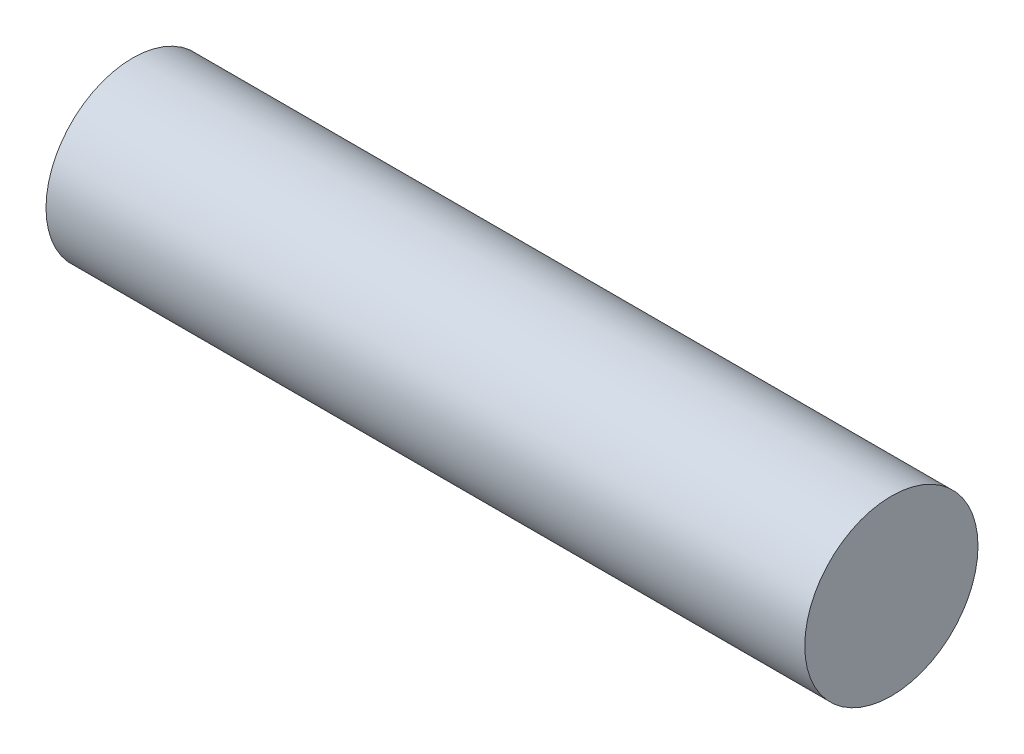
ISO-10303-21;
HEADER;
FILE_DESCRIPTION(('STEP AP214'),'2;1');
FILE_NAME('part.step','',(''),(''),'','','');
FILE_SCHEMA(('AUTOMOTIVE_DESIGN { 1 0 10303 214 1 1 1 1 }'));
ENDSEC;
DATA;
#1=APPLICATION_CONTEXT('core data for automotive mechanical design processes');
#2=APPLICATION_PROTOCOL_DEFINITION('international standard','automotive_design',2000,#1);
#3=PRODUCT_CONTEXT('',#1,'mechanical');
#4=PRODUCT('Part','Part','',(#3));
#5=PRODUCT_RELATED_PRODUCT_CATEGORY('part','',(#4));
#6=PRODUCT_DEFINITION_FORMATION('','',#4);
#7=PRODUCT_DEFINITION_CONTEXT('part definition',#1,'design');
#8=PRODUCT_DEFINITION('design','',#6,#7);
#9=PRODUCT_DEFINITION_SHAPE('','',#8);
#10=(LENGTH_UNIT() NAMED_UNIT(*) SI_UNIT(.MILLI.,.METRE.));
#11=(NAMED_UNIT(*) PLANE_ANGLE_UNIT() SI_UNIT($,.RADIAN.));
#12=(NAMED_UNIT(*) SI_UNIT($,.STERADIAN.) SOLID_ANGLE_UNIT());
#13=UNCERTAINTY_MEASURE_WITH_UNIT(LENGTH_MEASURE(1.E-05),#10,'distance_accuracy_value','');
#14=(GEOMETRIC_REPRESENTATION_CONTEXT(3) GLOBAL_UNCERTAINTY_ASSIGNED_CONTEXT((#13)) GLOBAL_UNIT_ASSIGNED_CONTEXT((#10,
#11,#12)) REPRESENTATION_CONTEXT('',''));
#15=CARTESIAN_POINT('',(0.,0.,0.));
#16=DIRECTION('',(0.,0.,1.));
#17=DIRECTION('',(1.,0.,0.));
#18=AXIS2_PLACEMENT_3D('',#15,#16,#17);
#19=CARTESIAN_POINT('',(55.626,0.,0.));
#20=DIRECTION('',(-1.,0.,0.));
#21=DIRECTION('',(0.,0.,1.));
#22=AXIS2_PLACEMENT_3D('',#19,#20,#21);
#23=CYLINDRICAL_SURFACE('',#22,6.35);
#24=CARTESIAN_POINT('',(55.626,0.,0.));
#25=DIRECTION('',(1.,0.,0.));
#26=DIRECTION('',(0.,0.,-1.));
#27=AXIS2_PLACEMENT_3D('',#24,#25,#26);
#28=CIRCLE('',#27,6.35);
#29=CARTESIAN_POINT('',(55.626,0.,-6.35));
#30=VERTEX_POINT('',#29);
#31=EDGE_CURVE('E10',#30,#30,#28,.T.);
#32=ORIENTED_EDGE('',*,*,#31,.F.);
#33=EDGE_LOOP('',(#32));
#34=FACE_BOUND('',#33,.T.);
#35=CARTESIAN_POINT('',(0.,0.,0.));
#36=DIRECTION('',(1.,0.,0.));
#37=DIRECTION('',(0.,0.,-1.));
#38=AXIS2_PLACEMENT_3D('',#35,#36,#37);
#39=CIRCLE('',#38,6.35);
#40=CARTESIAN_POINT('',(0.,0.,-6.35));
#41=VERTEX_POINT('',#40);
#42=EDGE_CURVE('E38',#41,#41,#39,.T.);
#43=ORIENTED_EDGE('',*,*,#42,.T.);
#44=EDGE_LOOP('',(#43));
#45=FACE_BOUND('',#44,.T.);
#46=ADVANCED_FACE('F35',(#34,#45),#23,.T.);
#47=CARTESIAN_POINT('',(55.626,0.,0.));
#48=DIRECTION('',(1.,0.,0.));
#49=DIRECTION('',(0.,0.,-1.));
#50=AXIS2_PLACEMENT_3D('',#47,#48,#49);
#51=PLANE('',#50);
#52=ORIENTED_EDGE('',*,*,#31,.T.);
#53=EDGE_LOOP('',(#52));
#54=FACE_BOUND('',#53,.T.);
#55=ADVANCED_FACE('F64',(#54),#51,.T.);
#56=CARTESIAN_POINT('',(0.,0.,0.));
#57=DIRECTION('',(1.,0.,0.));
#58=DIRECTION('',(0.,0.,-1.));
#59=AXIS2_PLACEMENT_3D('',#56,#57,#58);
#60=PLANE('',#59);
#61=CARTESIAN_POINT('',(0.,0.,0.));
#62=DIRECTION('',(-1.,0.,0.));
#63=DIRECTION('',(0.,0.,1.));
#64=AXIS2_PLACEMENT_3D('',#61,#62,#63);
#65=CIRCLE('',#64,3.17881);
#66=CARTESIAN_POINT('',(0.,0.,3.17881));
#67=VERTEX_POINT('',#66);
#68=EDGE_CURVE('E47',#67,#67,#65,.T.);
#69=ORIENTED_EDGE('',*,*,#68,.F.);
#70=EDGE_LOOP('',(#69));
#71=FACE_BOUND('',#70,.T.);
#72=ORIENTED_EDGE('',*,*,#42,.F.);
#73=EDGE_LOOP('',(#72));
#74=FACE_BOUND('',#73,.T.);
#75=ADVANCED_FACE('F58',(#71,#74),#60,.F.);
#76=CARTESIAN_POINT('',(12.7,0.,0.));
#77=DIRECTION('',(-1.,0.,0.));
#78=DIRECTION('',(0.,0.,1.));
#79=AXIS2_PLACEMENT_3D('',#76,#77,#78);
#80=CYLINDRICAL_SURFACE('',#79,3.17881);
#81=CARTESIAN_POINT('',(12.7,0.,0.));
#82=DIRECTION('',(-1.,0.,0.));
#83=DIRECTION('',(0.,0.,1.));
#84=AXIS2_PLACEMENT_3D('',#81,#82,#83);
#85=CIRCLE('',#84,3.17881);
#86=CARTESIAN_POINT('',(12.7,0.,3.17881));
#87=VERTEX_POINT('',#86);
#88=EDGE_CURVE('E45',#87,#87,#85,.T.);
#89=ORIENTED_EDGE('',*,*,#88,.F.);
#90=EDGE_LOOP('',(#89));
#91=FACE_BOUND('',#90,.T.);
#92=ORIENTED_EDGE('',*,*,#68,.T.);
#93=EDGE_LOOP('',(#92));
#94=FACE_BOUND('',#93,.T.);
#95=ADVANCED_FACE('F55',(#91,#94),#80,.F.);
#96=CARTESIAN_POINT('',(12.7,0.,0.));
#97=DIRECTION('',(-1.,0.,0.));
#98=DIRECTION('',(0.,0.,1.));
#99=AXIS2_PLACEMENT_3D('',#96,#97,#98);
#100=PLANE('',#99);
#101=ORIENTED_EDGE('',*,*,#88,.T.);
#102=EDGE_LOOP('',(#101));
#103=FACE_BOUND('',#102,.T.);
#104=ADVANCED_FACE('F53',(#103),#100,.T.);
#105=CLOSED_SHELL('',(#46,#55,#75,#95,#104));
#106=MANIFOLD_SOLID_BREP('B2',#105);
#107=ADVANCED_BREP_SHAPE_REPRESENTATION('',(#18,#106),#14);
#108=SHAPE_DEFINITION_REPRESENTATION(#9,#107);
ENDSEC;
END-ISO-10303-21;
